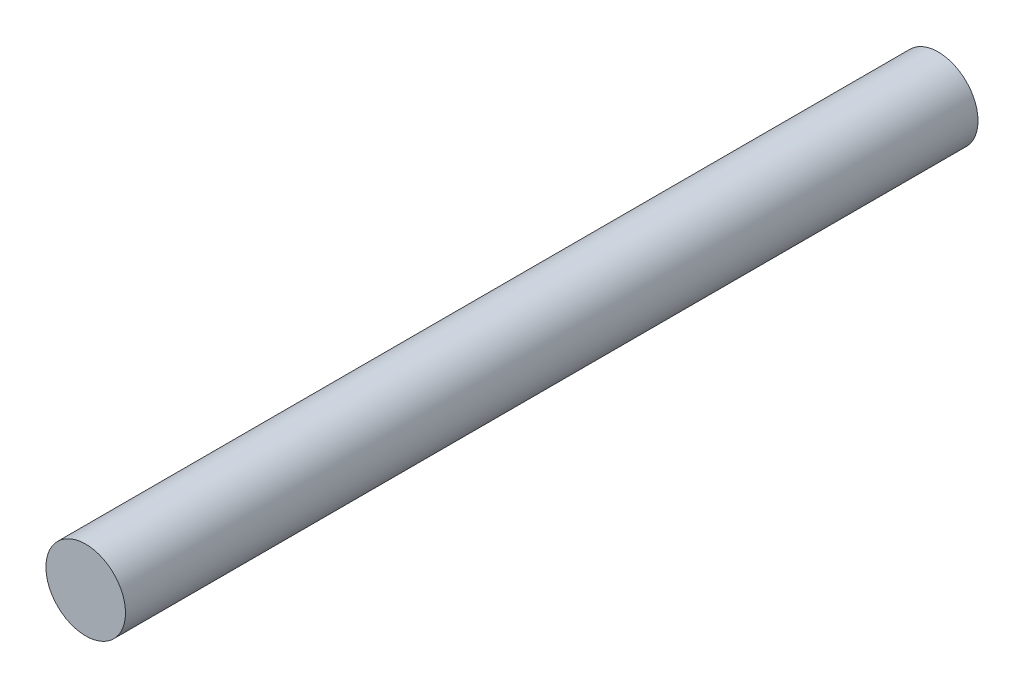
ISO-10303-21;
HEADER;
FILE_DESCRIPTION(('STEP AP214'),'2;1');
FILE_NAME('part.step','',(''),(''),'','','');
FILE_SCHEMA(('AUTOMOTIVE_DESIGN { 1 0 10303 214 1 1 1 1 }'));
ENDSEC;
DATA;
#1=APPLICATION_CONTEXT('core data for automotive mechanical design processes');
#2=APPLICATION_PROTOCOL_DEFINITION('international standard','automotive_design',2000,#1);
#3=PRODUCT_CONTEXT('',#1,'mechanical');
#4=PRODUCT('Part','Part','',(#3));
#5=PRODUCT_RELATED_PRODUCT_CATEGORY('part','',(#4));
#6=PRODUCT_DEFINITION_FORMATION('','',#4);
#7=PRODUCT_DEFINITION_CONTEXT('part definition',#1,'design');
#8=PRODUCT_DEFINITION('design','',#6,#7);
#9=PRODUCT_DEFINITION_SHAPE('','',#8);
#10=(LENGTH_UNIT() NAMED_UNIT(*) SI_UNIT(.MILLI.,.METRE.));
#11=(NAMED_UNIT(*) PLANE_ANGLE_UNIT() SI_UNIT($,.RADIAN.));
#12=(NAMED_UNIT(*) SI_UNIT($,.STERADIAN.) SOLID_ANGLE_UNIT());
#13=UNCERTAINTY_MEASURE_WITH_UNIT(LENGTH_MEASURE(1.E-05),#10,'distance_accuracy_value','');
#14=(GEOMETRIC_REPRESENTATION_CONTEXT(3) GLOBAL_UNCERTAINTY_ASSIGNED_CONTEXT((#13)) GLOBAL_UNIT_ASSIGNED_CONTEXT((#10,
#11,#12)) REPRESENTATION_CONTEXT('',''));
#15=CARTESIAN_POINT('',(0.,0.,0.));
#16=DIRECTION('',(0.,0.,1.));
#17=DIRECTION('',(1.,0.,0.));
#18=AXIS2_PLACEMENT_3D('',#15,#16,#17);
#19=CARTESIAN_POINT('',(0.,0.,75.));
#20=DIRECTION('',(0.,0.,-1.));
#21=DIRECTION('',(-1.,0.,0.));
#22=AXIS2_PLACEMENT_3D('',#19,#20,#21);
#23=CYLINDRICAL_SURFACE('',#22,3.5);
#24=CARTESIAN_POINT('',(0.,0.,75.));
#25=DIRECTION('',(0.,0.,1.));
#26=DIRECTION('',(1.,0.,0.));
#27=AXIS2_PLACEMENT_3D('',#24,#25,#26);
#28=CIRCLE('',#27,3.5);
#29=CARTESIAN_POINT('',(3.5,0.,75.));
#30=VERTEX_POINT('',#29);
#31=EDGE_CURVE('E10',#30,#30,#28,.T.);
#32=ORIENTED_EDGE('',*,*,#31,.F.);
#33=EDGE_LOOP('',(#32));
#34=FACE_BOUND('',#33,.T.);
#35=CARTESIAN_POINT('',(0.,0.,0.));
#36=DIRECTION('',(0.,0.,1.));
#37=DIRECTION('',(1.,0.,0.));
#38=AXIS2_PLACEMENT_3D('',#35,#36,#37);
#39=CIRCLE('',#38,3.5);
#40=CARTESIAN_POINT('',(3.5,0.,0.));
#41=VERTEX_POINT('',#40);
#42=EDGE_CURVE('E46',#41,#41,#39,.T.);
#43=ORIENTED_EDGE('',*,*,#42,.T.);
#44=EDGE_LOOP('',(#43));
#45=FACE_BOUND('',#44,.T.);
#46=ADVANCED_FACE('F43',(#34,#45),#23,.T.);
#47=CARTESIAN_POINT('',(0.,0.,75.));
#48=DIRECTION('',(0.,0.,1.));
#49=DIRECTION('',(1.,0.,0.));
#50=AXIS2_PLACEMENT_3D('',#47,#48,#49);
#51=PLANE('',#50);
#52=ORIENTED_EDGE('',*,*,#31,.T.);
#53=EDGE_LOOP('',(#52));
#54=FACE_BOUND('',#53,.T.);
#55=ADVANCED_FACE('F58',(#54),#51,.T.);
#56=CARTESIAN_POINT('',(0.,0.,0.));
#57=DIRECTION('',(0.,0.,1.));
#58=DIRECTION('',(1.,0.,0.));
#59=AXIS2_PLACEMENT_3D('',#56,#57,#58);
#60=PLANE('',#59);
#61=ORIENTED_EDGE('',*,*,#42,.F.);
#62=EDGE_LOOP('',(#61));
#63=FACE_BOUND('',#62,.T.);
#64=ADVANCED_FACE('F56',(#63),#60,.F.);
#65=CLOSED_SHELL('',(#46,#55,#64));
#66=MANIFOLD_SOLID_BREP('B2',#65);
#67=ADVANCED_BREP_SHAPE_REPRESENTATION('',(#18,#66),#14);
#68=SHAPE_DEFINITION_REPRESENTATION(#9,#67);
ENDSEC;
END-ISO-10303-21;
